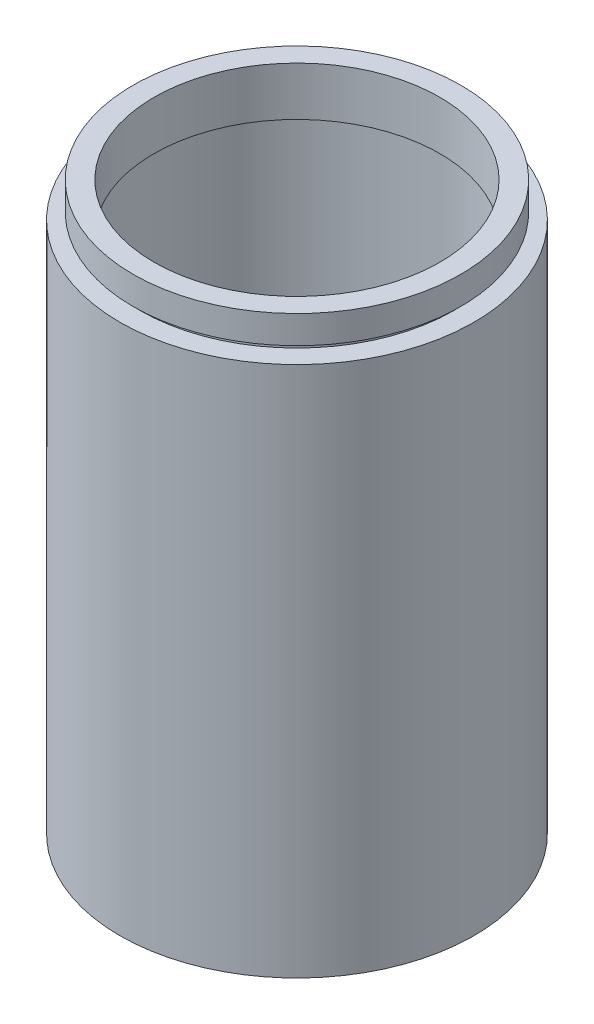
ISO-10303-21;
HEADER;
FILE_DESCRIPTION(('STEP AP214'),'2;1');
FILE_NAME('part.step','',(''),(''),'','','');
FILE_SCHEMA(('AUTOMOTIVE_DESIGN { 1 0 10303 214 1 1 1 1 }'));
ENDSEC;
DATA;
#1=APPLICATION_CONTEXT('core data for automotive mechanical design processes');
#2=APPLICATION_PROTOCOL_DEFINITION('international standard','automotive_design',2000,#1);
#3=PRODUCT_CONTEXT('',#1,'mechanical');
#4=PRODUCT('Part','Part','',(#3));
#5=PRODUCT_RELATED_PRODUCT_CATEGORY('part','',(#4));
#6=PRODUCT_DEFINITION_FORMATION('','',#4);
#7=PRODUCT_DEFINITION_CONTEXT('part definition',#1,'design');
#8=PRODUCT_DEFINITION('design','',#6,#7);
#9=PRODUCT_DEFINITION_SHAPE('','',#8);
#10=(LENGTH_UNIT() NAMED_UNIT(*) SI_UNIT(.MILLI.,.METRE.));
#11=(NAMED_UNIT(*) PLANE_ANGLE_UNIT() SI_UNIT($,.RADIAN.));
#12=(NAMED_UNIT(*) SI_UNIT($,.STERADIAN.) SOLID_ANGLE_UNIT());
#13=UNCERTAINTY_MEASURE_WITH_UNIT(LENGTH_MEASURE(1.E-05),#10,'distance_accuracy_value','');
#14=(GEOMETRIC_REPRESENTATION_CONTEXT(3) GLOBAL_UNCERTAINTY_ASSIGNED_CONTEXT((#13)) GLOBAL_UNIT_ASSIGNED_CONTEXT((#10,
#11,#12)) REPRESENTATION_CONTEXT('',''));
#15=CARTESIAN_POINT('',(0.,0.,0.));
#16=DIRECTION('',(0.,0.,1.));
#17=DIRECTION('',(1.,0.,0.));
#18=AXIS2_PLACEMENT_3D('',#15,#16,#17);
#19=CARTESIAN_POINT('',(25.4,76.2,0.));
#20=DIRECTION('',(0.,-1.,0.));
#21=DIRECTION('',(0.,0.,-1.));
#22=AXIS2_PLACEMENT_3D('',#19,#20,#21);
#23=PLANE('',#22);
#24=CARTESIAN_POINT('',(0.,76.2,0.));
#25=DIRECTION('',(0.,1.,0.));
#26=DIRECTION('',(0.,0.,1.));
#27=AXIS2_PLACEMENT_3D('',#24,#25,#26);
#28=CIRCLE('',#27,22.4999999999999);
#29=CARTESIAN_POINT('',(0.,76.2,22.4999999999999));
#30=VERTEX_POINT('',#29);
#31=EDGE_CURVE('E87',#30,#30,#28,.T.);
#32=ORIENTED_EDGE('',*,*,#31,.F.);
#33=EDGE_LOOP('',(#32));
#34=FACE_BOUND('',#33,.T.);
#35=CARTESIAN_POINT('',(0.,76.2,0.));
#36=DIRECTION('',(0.,1.,0.));
#37=DIRECTION('',(0.,0.,1.));
#38=AXIS2_PLACEMENT_3D('',#35,#36,#37);
#39=CIRCLE('',#38,25.4);
#40=CARTESIAN_POINT('',(0.,76.2,25.4));
#41=VERTEX_POINT('',#40);
#42=EDGE_CURVE('E10',#41,#41,#39,.T.);
#43=ORIENTED_EDGE('',*,*,#42,.T.);
#44=EDGE_LOOP('',(#43));
#45=FACE_BOUND('',#44,.T.);
#46=ADVANCED_FACE('F35',(#34,#45),#23,.F.);
#47=CARTESIAN_POINT('',(0.,161.376166943427,0.));
#48=DIRECTION('',(0.,1.,0.));
#49=DIRECTION('',(0.,0.,1.));
#50=AXIS2_PLACEMENT_3D('',#47,#48,#49);
#51=CYLINDRICAL_SURFACE('',#50,25.4);
#52=ORIENTED_EDGE('',*,*,#42,.F.);
#53=EDGE_LOOP('',(#52));
#54=FACE_BOUND('',#53,.T.);
#55=CARTESIAN_POINT('',(0.,0.,0.));
#56=DIRECTION('',(0.,1.,0.));
#57=DIRECTION('',(0.,0.,1.));
#58=AXIS2_PLACEMENT_3D('',#55,#56,#57);
#59=CIRCLE('',#58,25.4);
#60=CARTESIAN_POINT('',(0.,0.,25.4));
#61=VERTEX_POINT('',#60);
#62=EDGE_CURVE('E41',#61,#61,#59,.T.);
#63=ORIENTED_EDGE('',*,*,#62,.T.);
#64=EDGE_LOOP('',(#63));
#65=FACE_BOUND('',#64,.T.);
#66=ADVANCED_FACE('F94',(#54,#65),#51,.T.);
#67=CARTESIAN_POINT('',(25.4,0.,0.));
#68=DIRECTION('',(0.,1.,0.));
#69=DIRECTION('',(0.,0.,1.));
#70=AXIS2_PLACEMENT_3D('',#67,#68,#69);
#71=PLANE('',#70);
#72=ORIENTED_EDGE('',*,*,#62,.F.);
#73=EDGE_LOOP('',(#72));
#74=FACE_BOUND('',#73,.T.);
#75=CARTESIAN_POINT('',(0.,0.,0.));
#76=DIRECTION('',(0.,1.,0.));
#77=DIRECTION('',(0.,0.,1.));
#78=AXIS2_PLACEMENT_3D('',#75,#76,#77);
#79=CIRCLE('',#78,22.5);
#80=CARTESIAN_POINT('',(0.,0.,22.5));
#81=VERTEX_POINT('',#80);
#82=EDGE_CURVE('E45',#81,#81,#79,.T.);
#83=ORIENTED_EDGE('',*,*,#82,.T.);
#84=EDGE_LOOP('',(#83));
#85=FACE_BOUND('',#84,.T.);
#86=ADVANCED_FACE('F98',(#74,#85),#71,.F.);
#87=CARTESIAN_POINT('',(0.,161.376166943427,0.));
#88=DIRECTION('',(0.,1.,0.));
#89=DIRECTION('',(0.,0.,1.));
#90=AXIS2_PLACEMENT_3D('',#87,#88,#89);
#91=CYLINDRICAL_SURFACE('',#90,22.5);
#92=ORIENTED_EDGE('',*,*,#82,.F.);
#93=EDGE_LOOP('',(#92));
#94=FACE_BOUND('',#93,.T.);
#95=CARTESIAN_POINT('',(0.,5.49999999999998,0.));
#96=DIRECTION('',(0.,1.,0.));
#97=DIRECTION('',(0.,0.,1.));
#98=AXIS2_PLACEMENT_3D('',#95,#96,#97);
#99=CIRCLE('',#98,22.5);
#100=CARTESIAN_POINT('',(0.,5.49999999999998,22.5));
#101=VERTEX_POINT('',#100);
#102=EDGE_CURVE('E49',#101,#101,#99,.T.);
#103=ORIENTED_EDGE('',*,*,#102,.T.);
#104=EDGE_LOOP('',(#103));
#105=FACE_BOUND('',#104,.T.);
#106=ADVANCED_FACE('F103',(#94,#105),#91,.F.);
#107=CARTESIAN_POINT('',(22.5,5.49999999999999,0.));
#108=DIRECTION('',(0.,-1.,0.));
#109=DIRECTION('',(0.,0.,-1.));
#110=AXIS2_PLACEMENT_3D('',#107,#108,#109);
#111=PLANE('',#110);
#112=ORIENTED_EDGE('',*,*,#102,.F.);
#113=EDGE_LOOP('',(#112));
#114=FACE_BOUND('',#113,.T.);
#115=CARTESIAN_POINT('',(0.,5.49999999999998,0.));
#116=DIRECTION('',(0.,1.,0.));
#117=DIRECTION('',(0.,0.,1.));
#118=AXIS2_PLACEMENT_3D('',#115,#116,#117);
#119=CIRCLE('',#118,23.4999999999999);
#120=CARTESIAN_POINT('',(0.,5.49999999999998,23.4999999999999));
#121=VERTEX_POINT('',#120);
#122=EDGE_CURVE('E54',#121,#121,#119,.T.);
#123=ORIENTED_EDGE('',*,*,#122,.T.);
#124=EDGE_LOOP('',(#123));
#125=FACE_BOUND('',#124,.T.);
#126=ADVANCED_FACE('F109',(#114,#125),#111,.F.);
#127=CARTESIAN_POINT('',(0.,161.376166943427,0.));
#128=DIRECTION('',(0.,1.,0.));
#129=DIRECTION('',(0.,0.,1.));
#130=AXIS2_PLACEMENT_3D('',#127,#128,#129);
#131=CYLINDRICAL_SURFACE('',#130,23.4999999999999);
#132=ORIENTED_EDGE('',*,*,#122,.F.);
#133=EDGE_LOOP('',(#132));
#134=FACE_BOUND('',#133,.T.);
#135=CARTESIAN_POINT('',(0.,6.49999999999998,0.));
#136=DIRECTION('',(0.,1.,0.));
#137=DIRECTION('',(0.,0.,1.));
#138=AXIS2_PLACEMENT_3D('',#135,#136,#137);
#139=CIRCLE('',#138,23.4999999999999);
#140=CARTESIAN_POINT('',(0.,6.49999999999998,23.4999999999999));
#141=VERTEX_POINT('',#140);
#142=EDGE_CURVE('E57',#141,#141,#139,.T.);
#143=ORIENTED_EDGE('',*,*,#142,.T.);
#144=EDGE_LOOP('',(#143));
#145=FACE_BOUND('',#144,.T.);
#146=ADVANCED_FACE('F113',(#134,#145),#131,.F.);
#147=CARTESIAN_POINT('',(23.4999999999999,6.49999999999999,0.));
#148=DIRECTION('',(0.,1.,0.));
#149=DIRECTION('',(0.,0.,1.));
#150=AXIS2_PLACEMENT_3D('',#147,#148,#149);
#151=PLANE('',#150);
#152=ORIENTED_EDGE('',*,*,#142,.F.);
#153=EDGE_LOOP('',(#152));
#154=FACE_BOUND('',#153,.T.);
#155=CARTESIAN_POINT('',(0.,6.49999999999998,0.));
#156=DIRECTION('',(0.,1.,0.));
#157=DIRECTION('',(0.,0.,1.));
#158=AXIS2_PLACEMENT_3D('',#155,#156,#157);
#159=CIRCLE('',#158,22.5);
#160=CARTESIAN_POINT('',(0.,6.49999999999998,22.5));
#161=VERTEX_POINT('',#160);
#162=EDGE_CURVE('E60',#161,#161,#159,.T.);
#163=ORIENTED_EDGE('',*,*,#162,.T.);
#164=EDGE_LOOP('',(#163));
#165=FACE_BOUND('',#164,.T.);
#166=ADVANCED_FACE('F117',(#154,#165),#151,.F.);
#167=CARTESIAN_POINT('',(0.,161.376166943427,0.));
#168=DIRECTION('',(0.,1.,0.));
#169=DIRECTION('',(0.,0.,1.));
#170=AXIS2_PLACEMENT_3D('',#167,#168,#169);
#171=CYLINDRICAL_SURFACE('',#170,22.5);
#172=ORIENTED_EDGE('',*,*,#162,.F.);
#173=EDGE_LOOP('',(#172));
#174=FACE_BOUND('',#173,.T.);
#175=CARTESIAN_POINT('',(0.,73.2,0.));
#176=DIRECTION('',(0.,1.,0.));
#177=DIRECTION('',(0.,0.,1.));
#178=AXIS2_PLACEMENT_3D('',#175,#176,#177);
#179=CIRCLE('',#178,22.5);
#180=CARTESIAN_POINT('',(0.,73.2,22.5));
#181=VERTEX_POINT('',#180);
#182=EDGE_CURVE('E63',#181,#181,#179,.T.);
#183=ORIENTED_EDGE('',*,*,#182,.T.);
#184=EDGE_LOOP('',(#183));
#185=FACE_BOUND('',#184,.T.);
#186=ADVANCED_FACE('F121',(#174,#185),#171,.F.);
#187=CARTESIAN_POINT('',(22.5,73.2,0.));
#188=DIRECTION('',(0.,-1.,0.));
#189=DIRECTION('',(0.,0.,-1.));
#190=AXIS2_PLACEMENT_3D('',#187,#188,#189);
#191=PLANE('',#190);
#192=ORIENTED_EDGE('',*,*,#182,.F.);
#193=EDGE_LOOP('',(#192));
#194=FACE_BOUND('',#193,.T.);
#195=CARTESIAN_POINT('',(0.,73.2,0.));
#196=DIRECTION('',(0.,1.,0.));
#197=DIRECTION('',(0.,0.,1.));
#198=AXIS2_PLACEMENT_3D('',#195,#196,#197);
#199=CIRCLE('',#198,23.4999999999999);
#200=CARTESIAN_POINT('',(0.,73.2,23.4999999999999));
#201=VERTEX_POINT('',#200);
#202=EDGE_CURVE('E66',#201,#201,#199,.T.);
#203=ORIENTED_EDGE('',*,*,#202,.T.);
#204=EDGE_LOOP('',(#203));
#205=FACE_BOUND('',#204,.T.);
#206=ADVANCED_FACE('F125',(#194,#205),#191,.F.);
#207=CARTESIAN_POINT('',(0.,161.376166943427,0.));
#208=DIRECTION('',(0.,1.,0.));
#209=DIRECTION('',(0.,0.,1.));
#210=AXIS2_PLACEMENT_3D('',#207,#208,#209);
#211=CYLINDRICAL_SURFACE('',#210,23.4999999999999);
#212=ORIENTED_EDGE('',*,*,#202,.F.);
#213=EDGE_LOOP('',(#212));
#214=FACE_BOUND('',#213,.T.);
#215=CARTESIAN_POINT('',(0.,74.2,0.));
#216=DIRECTION('',(0.,1.,0.));
#217=DIRECTION('',(0.,0.,1.));
#218=AXIS2_PLACEMENT_3D('',#215,#216,#217);
#219=CIRCLE('',#218,23.4999999999999);
#220=CARTESIAN_POINT('',(0.,74.2,23.4999999999999));
#221=VERTEX_POINT('',#220);
#222=EDGE_CURVE('E69',#221,#221,#219,.T.);
#223=ORIENTED_EDGE('',*,*,#222,.T.);
#224=EDGE_LOOP('',(#223));
#225=FACE_BOUND('',#224,.T.);
#226=ADVANCED_FACE('F129',(#214,#225),#211,.F.);
#227=CARTESIAN_POINT('',(23.4999999999999,74.2,0.));
#228=DIRECTION('',(0.,1.,0.));
#229=DIRECTION('',(0.,0.,1.));
#230=AXIS2_PLACEMENT_3D('',#227,#228,#229);
#231=PLANE('',#230);
#232=ORIENTED_EDGE('',*,*,#222,.F.);
#233=EDGE_LOOP('',(#232));
#234=FACE_BOUND('',#233,.T.);
#235=CARTESIAN_POINT('',(0.,74.2,0.));
#236=DIRECTION('',(0.,1.,0.));
#237=DIRECTION('',(0.,0.,1.));
#238=AXIS2_PLACEMENT_3D('',#235,#236,#237);
#239=CIRCLE('',#238,20.5);
#240=CARTESIAN_POINT('',(0.,74.2,20.5));
#241=VERTEX_POINT('',#240);
#242=EDGE_CURVE('E72',#241,#241,#239,.T.);
#243=ORIENTED_EDGE('',*,*,#242,.T.);
#244=EDGE_LOOP('',(#243));
#245=FACE_BOUND('',#244,.T.);
#246=ADVANCED_FACE('F133',(#234,#245),#231,.F.);
#247=CARTESIAN_POINT('',(0.,161.376166943427,0.));
#248=DIRECTION('',(0.,1.,0.));
#249=DIRECTION('',(0.,0.,1.));
#250=AXIS2_PLACEMENT_3D('',#247,#248,#249);
#251=CYLINDRICAL_SURFACE('',#250,20.5);
#252=ORIENTED_EDGE('',*,*,#242,.F.);
#253=EDGE_LOOP('',(#252));
#254=FACE_BOUND('',#253,.T.);
#255=CARTESIAN_POINT('',(0.,81.2,0.));
#256=DIRECTION('',(0.,1.,0.));
#257=DIRECTION('',(0.,0.,1.));
#258=AXIS2_PLACEMENT_3D('',#255,#256,#257);
#259=CIRCLE('',#258,20.5);
#260=CARTESIAN_POINT('',(0.,81.2,20.5));
#261=VERTEX_POINT('',#260);
#262=EDGE_CURVE('E75',#261,#261,#259,.T.);
#263=ORIENTED_EDGE('',*,*,#262,.T.);
#264=EDGE_LOOP('',(#263));
#265=FACE_BOUND('',#264,.T.);
#266=ADVANCED_FACE('F137',(#254,#265),#251,.F.);
#267=CARTESIAN_POINT('',(20.5,81.2,0.));
#268=DIRECTION('',(0.,-1.,0.));
#269=DIRECTION('',(0.,0.,-1.));
#270=AXIS2_PLACEMENT_3D('',#267,#268,#269);
#271=PLANE('',#270);
#272=ORIENTED_EDGE('',*,*,#262,.F.);
#273=EDGE_LOOP('',(#272));
#274=FACE_BOUND('',#273,.T.);
#275=CARTESIAN_POINT('',(0.,81.2,0.));
#276=DIRECTION('',(0.,1.,0.));
#277=DIRECTION('',(0.,0.,1.));
#278=AXIS2_PLACEMENT_3D('',#275,#276,#277);
#279=CIRCLE('',#278,23.4999999999999);
#280=CARTESIAN_POINT('',(0.,81.2,23.4999999999999));
#281=VERTEX_POINT('',#280);
#282=EDGE_CURVE('E78',#281,#281,#279,.T.);
#283=ORIENTED_EDGE('',*,*,#282,.T.);
#284=EDGE_LOOP('',(#283));
#285=FACE_BOUND('',#284,.T.);
#286=ADVANCED_FACE('F141',(#274,#285),#271,.F.);
#287=CARTESIAN_POINT('',(0.,161.376166943427,0.));
#288=DIRECTION('',(0.,1.,0.));
#289=DIRECTION('',(0.,0.,1.));
#290=AXIS2_PLACEMENT_3D('',#287,#288,#289);
#291=CYLINDRICAL_SURFACE('',#290,23.4999999999999);
#292=ORIENTED_EDGE('',*,*,#282,.F.);
#293=EDGE_LOOP('',(#292));
#294=FACE_BOUND('',#293,.T.);
#295=CARTESIAN_POINT('',(0.,77.2,0.));
#296=DIRECTION('',(0.,1.,0.));
#297=DIRECTION('',(0.,0.,1.));
#298=AXIS2_PLACEMENT_3D('',#295,#296,#297);
#299=CIRCLE('',#298,23.4999999999999);
#300=CARTESIAN_POINT('',(0.,77.2,23.4999999999999));
#301=VERTEX_POINT('',#300);
#302=EDGE_CURVE('E81',#301,#301,#299,.T.);
#303=ORIENTED_EDGE('',*,*,#302,.T.);
#304=EDGE_LOOP('',(#303));
#305=FACE_BOUND('',#304,.T.);
#306=ADVANCED_FACE('F145',(#294,#305),#291,.T.);
#307=CARTESIAN_POINT('',(23.4999999999999,77.2,0.));
#308=DIRECTION('',(0.,1.,0.));
#309=DIRECTION('',(0.,0.,1.));
#310=AXIS2_PLACEMENT_3D('',#307,#308,#309);
#311=PLANE('',#310);
#312=ORIENTED_EDGE('',*,*,#302,.F.);
#313=EDGE_LOOP('',(#312));
#314=FACE_BOUND('',#313,.T.);
#315=CARTESIAN_POINT('',(0.,77.2,0.));
#316=DIRECTION('',(0.,1.,0.));
#317=DIRECTION('',(0.,0.,1.));
#318=AXIS2_PLACEMENT_3D('',#315,#316,#317);
#319=CIRCLE('',#318,22.4999999999999);
#320=CARTESIAN_POINT('',(0.,77.2,22.4999999999999));
#321=VERTEX_POINT('',#320);
#322=EDGE_CURVE('E84',#321,#321,#319,.T.);
#323=ORIENTED_EDGE('',*,*,#322,.T.);
#324=EDGE_LOOP('',(#323));
#325=FACE_BOUND('',#324,.T.);
#326=ADVANCED_FACE('F149',(#314,#325),#311,.F.);
#327=CARTESIAN_POINT('',(0.,161.376166943427,0.));
#328=DIRECTION('',(0.,1.,0.));
#329=DIRECTION('',(0.,0.,1.));
#330=AXIS2_PLACEMENT_3D('',#327,#328,#329);
#331=CYLINDRICAL_SURFACE('',#330,22.4999999999999);
#332=ORIENTED_EDGE('',*,*,#322,.F.);
#333=EDGE_LOOP('',(#332));
#334=FACE_BOUND('',#333,.T.);
#335=ORIENTED_EDGE('',*,*,#31,.T.);
#336=EDGE_LOOP('',(#335));
#337=FACE_BOUND('',#336,.T.);
#338=ADVANCED_FACE('F91',(#334,#337),#331,.T.);
#339=CLOSED_SHELL('',(#46,#66,#86,#106,#126,#146,#166,#186,#206,#226,#246,#266,#286,#306,#326,#338));
#340=MANIFOLD_SOLID_BREP('B2',#339);
#341=ADVANCED_BREP_SHAPE_REPRESENTATION('',(#18,#340),#14);
#342=SHAPE_DEFINITION_REPRESENTATION(#9,#341);
ENDSEC;
END-ISO-10303-21;
